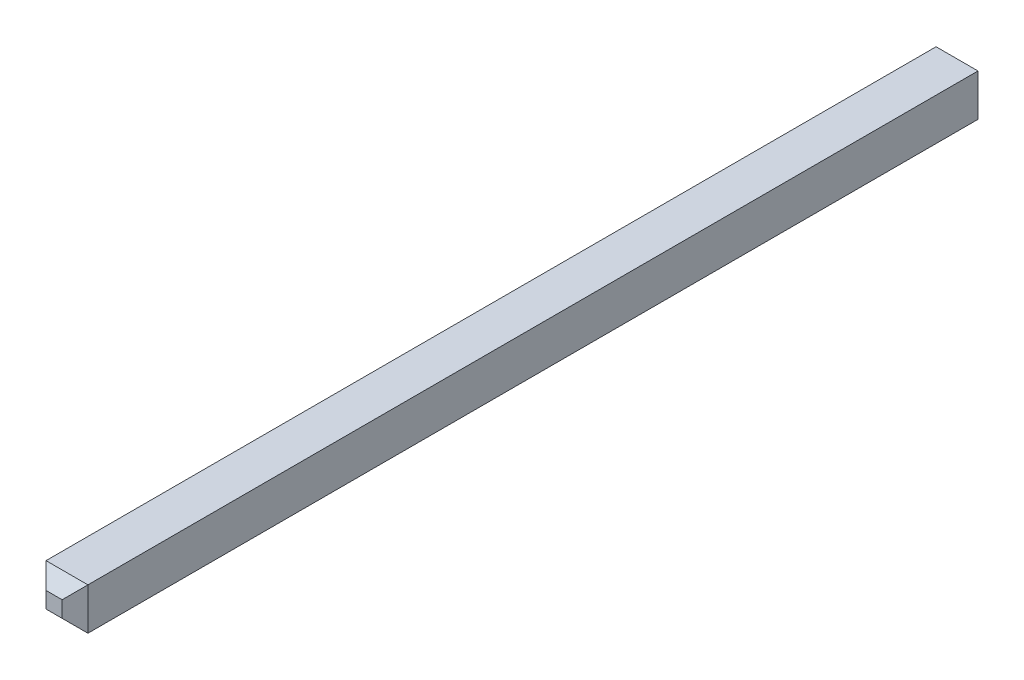
ISO-10303-21;
HEADER;
FILE_DESCRIPTION(('STEP AP214'),'2;1');
FILE_NAME('part.step','',(''),(''),'','','');
FILE_SCHEMA(('AUTOMOTIVE_DESIGN { 1 0 10303 214 1 1 1 1 }'));
ENDSEC;
DATA;
#1=APPLICATION_CONTEXT('core data for automotive mechanical design processes');
#2=APPLICATION_PROTOCOL_DEFINITION('international standard','automotive_design',2000,#1);
#3=PRODUCT_CONTEXT('',#1,'mechanical');
#4=PRODUCT('Part','Part','',(#3));
#5=PRODUCT_RELATED_PRODUCT_CATEGORY('part','',(#4));
#6=PRODUCT_DEFINITION_FORMATION('','',#4);
#7=PRODUCT_DEFINITION_CONTEXT('part definition',#1,'design');
#8=PRODUCT_DEFINITION('design','',#6,#7);
#9=PRODUCT_DEFINITION_SHAPE('','',#8);
#10=(LENGTH_UNIT() NAMED_UNIT(*) SI_UNIT(.MILLI.,.METRE.));
#11=(NAMED_UNIT(*) PLANE_ANGLE_UNIT() SI_UNIT($,.RADIAN.));
#12=(NAMED_UNIT(*) SI_UNIT($,.STERADIAN.) SOLID_ANGLE_UNIT());
#13=UNCERTAINTY_MEASURE_WITH_UNIT(LENGTH_MEASURE(1.E-05),#10,'distance_accuracy_value','');
#14=(GEOMETRIC_REPRESENTATION_CONTEXT(3) GLOBAL_UNCERTAINTY_ASSIGNED_CONTEXT((#13)) GLOBAL_UNIT_ASSIGNED_CONTEXT((#10,
#11,#12)) REPRESENTATION_CONTEXT('',''));
#15=CARTESIAN_POINT('',(0.,0.,0.));
#16=DIRECTION('',(0.,0.,1.));
#17=DIRECTION('',(1.,0.,0.));
#18=AXIS2_PLACEMENT_3D('',#15,#16,#17);
#19=CARTESIAN_POINT('',(-0.225,0.,-0.1));
#20=DIRECTION('',(-0.707106781186548,0.,0.707106781186548));
#21=DIRECTION('',(0.707106781186548,0.,0.707106781186548));
#22=AXIS2_PLACEMENT_3D('',#19,#20,#21);
#23=PLANE('',#22);
#24=DIRECTION('',(0.,1.,0.));
#25=VECTOR('',#24,1.);
#26=CARTESIAN_POINT('',(-0.325,0.325,-0.2));
#27=LINE('',#26,#25);
#28=CARTESIAN_POINT('',(-0.325,-0.325,-0.2));
#29=VERTEX_POINT('',#28);
#30=CARTESIAN_POINT('',(-0.325,0.325,-0.2));
#31=VERTEX_POINT('',#30);
#32=EDGE_CURVE('E114',#29,#31,#27,.T.);
#33=ORIENTED_EDGE('',*,*,#32,.F.);
#34=DIRECTION('',(-0.577350269189626,-0.577350269189626,-0.577350269189626));
#35=VECTOR('',#34,1.);
#36=CARTESIAN_POINT('',(-0.125,-0.125,0.));
#37=LINE('',#36,#35);
#38=CARTESIAN_POINT('',(-0.125,-0.125,0.));
#39=VERTEX_POINT('',#38);
#40=EDGE_CURVE('E112',#39,#29,#37,.T.);
#41=ORIENTED_EDGE('',*,*,#40,.F.);
#42=DIRECTION('',(0.,1.,0.));
#43=VECTOR('',#42,1.);
#44=CARTESIAN_POINT('',(-0.125,0.,0.));
#45=LINE('',#44,#43);
#46=CARTESIAN_POINT('',(-0.125,0.125,0.));
#47=VERTEX_POINT('',#46);
#48=EDGE_CURVE('E19',#47,#39,#45,.F.);
#49=ORIENTED_EDGE('',*,*,#48,.F.);
#50=DIRECTION('',(0.577350269189626,-0.577350269189626,0.577350269189626));
#51=VECTOR('',#50,1.);
#52=CARTESIAN_POINT('',(-0.325,0.325,-0.2));
#53=LINE('',#52,#51);
#54=EDGE_CURVE('E137',#31,#47,#53,.T.);
#55=ORIENTED_EDGE('',*,*,#54,.F.);
#56=EDGE_LOOP('',(#33,#41,#49,#55));
#57=FACE_BOUND('',#56,.T.);
#58=ADVANCED_FACE('F16',(#57),#23,.T.);
#59=CARTESIAN_POINT('',(-0.225,0.,-14.1));
#60=DIRECTION('',(-0.707106781186548,0.,-0.707106781186548));
#61=DIRECTION('',(-0.707106781186548,0.,0.707106781186548));
#62=AXIS2_PLACEMENT_3D('',#59,#60,#61);
#63=PLANE('',#62);
#64=DIRECTION('',(0.,1.,0.));
#65=VECTOR('',#64,1.);
#66=CARTESIAN_POINT('',(-0.125,0.,-14.2));
#67=LINE('',#66,#65);
#68=CARTESIAN_POINT('',(-0.125,0.125,-14.2));
#69=VERTEX_POINT('',#68);
#70=CARTESIAN_POINT('',(-0.125,-0.125,-14.2));
#71=VERTEX_POINT('',#70);
#72=EDGE_CURVE('E95',#69,#71,#67,.F.);
#73=ORIENTED_EDGE('',*,*,#72,.T.);
#74=DIRECTION('',(0.577350269189625,0.577350269189626,-0.577350269189626));
#75=VECTOR('',#74,1.);
#76=CARTESIAN_POINT('',(-0.325,-0.325000000000001,-14.));
#77=LINE('',#76,#75);
#78=CARTESIAN_POINT('',(-0.325,-0.325,-14.));
#79=VERTEX_POINT('',#78);
#80=EDGE_CURVE('E129',#79,#71,#77,.T.);
#81=ORIENTED_EDGE('',*,*,#80,.F.);
#82=DIRECTION('',(0.,1.,0.));
#83=VECTOR('',#82,1.);
#84=CARTESIAN_POINT('',(-0.325,0.325,-14.));
#85=LINE('',#84,#83);
#86=CARTESIAN_POINT('',(-0.325,0.325,-14.));
#87=VERTEX_POINT('',#86);
#88=EDGE_CURVE('E151',#87,#79,#85,.F.);
#89=ORIENTED_EDGE('',*,*,#88,.F.);
#90=DIRECTION('',(-0.577350269189625,0.577350269189626,0.577350269189626));
#91=VECTOR('',#90,1.);
#92=CARTESIAN_POINT('',(-0.125,0.125,-14.2));
#93=LINE('',#92,#91);
#94=EDGE_CURVE('E146',#69,#87,#93,.T.);
#95=ORIENTED_EDGE('',*,*,#94,.F.);
#96=EDGE_LOOP('',(#73,#81,#89,#95));
#97=FACE_BOUND('',#96,.T.);
#98=ADVANCED_FACE('F328',(#97),#63,.T.);
#99=CARTESIAN_POINT('',(0.,0.,0.));
#100=DIRECTION('',(0.,0.,1.));
#101=DIRECTION('',(1.,0.,0.));
#102=AXIS2_PLACEMENT_3D('',#99,#100,#101);
#103=PLANE('',#102);
#104=ORIENTED_EDGE('',*,*,#48,.T.);
#105=DIRECTION('',(1.,0.,0.));
#106=VECTOR('',#105,1.);
#107=CARTESIAN_POINT('',(0.,-0.125,0.));
#108=LINE('',#107,#106);
#109=CARTESIAN_POINT('',(0.125,-0.125,0.));
#110=VERTEX_POINT('',#109);
#111=EDGE_CURVE('E105',#110,#39,#108,.F.);
#112=ORIENTED_EDGE('',*,*,#111,.F.);
#113=DIRECTION('',(0.,1.,0.));
#114=VECTOR('',#113,1.);
#115=CARTESIAN_POINT('',(0.125,0.,0.));
#116=LINE('',#115,#114);
#117=CARTESIAN_POINT('',(0.125,0.125,0.));
#118=VERTEX_POINT('',#117);
#119=EDGE_CURVE('E159',#118,#110,#116,.F.);
#120=ORIENTED_EDGE('',*,*,#119,.F.);
#121=DIRECTION('',(1.,0.,0.));
#122=VECTOR('',#121,1.);
#123=CARTESIAN_POINT('',(0.,0.125,0.));
#124=LINE('',#123,#122);
#125=EDGE_CURVE('E107',#47,#118,#124,.T.);
#126=ORIENTED_EDGE('',*,*,#125,.F.);
#127=EDGE_LOOP('',(#104,#112,#120,#126));
#128=FACE_BOUND('',#127,.T.);
#129=ADVANCED_FACE('F102',(#128),#103,.T.);
#130=CARTESIAN_POINT('',(0.,-0.225,-0.1));
#131=DIRECTION('',(0.,-0.707106781186548,0.707106781186548));
#132=DIRECTION('',(0.,-0.707106781186548,-0.707106781186548));
#133=AXIS2_PLACEMENT_3D('',#130,#131,#132);
#134=PLANE('',#133);
#135=ORIENTED_EDGE('',*,*,#111,.T.);
#136=ORIENTED_EDGE('',*,*,#40,.T.);
#137=DIRECTION('',(1.,0.,0.));
#138=VECTOR('',#137,1.);
#139=CARTESIAN_POINT('',(-0.325,-0.325,-0.2));
#140=LINE('',#139,#138);
#141=CARTESIAN_POINT('',(0.325,-0.325,-0.2));
#142=VERTEX_POINT('',#141);
#143=EDGE_CURVE('E164',#142,#29,#140,.F.);
#144=ORIENTED_EDGE('',*,*,#143,.F.);
#145=DIRECTION('',(0.577350269189626,-0.577350269189626,-0.577350269189626));
#146=VECTOR('',#145,1.);
#147=CARTESIAN_POINT('',(0.125,-0.125,0.));
#148=LINE('',#147,#146);
#149=EDGE_CURVE('E121',#110,#142,#148,.T.);
#150=ORIENTED_EDGE('',*,*,#149,.F.);
#151=EDGE_LOOP('',(#135,#136,#144,#150));
#152=FACE_BOUND('',#151,.T.);
#153=ADVANCED_FACE('F119',(#152),#134,.T.);
#154=CARTESIAN_POINT('',(0.,0.,-14.2));
#155=DIRECTION('',(0.,0.,1.));
#156=DIRECTION('',(1.,0.,0.));
#157=AXIS2_PLACEMENT_3D('',#154,#155,#156);
#158=PLANE('',#157);
#159=DIRECTION('',(0.,1.,0.));
#160=VECTOR('',#159,1.);
#161=CARTESIAN_POINT('',(0.125,0.,-14.2));
#162=LINE('',#161,#160);
#163=CARTESIAN_POINT('',(0.125,-0.125,-14.2));
#164=VERTEX_POINT('',#163);
#165=CARTESIAN_POINT('',(0.125,0.125,-14.2));
#166=VERTEX_POINT('',#165);
#167=EDGE_CURVE('E175',#164,#166,#162,.T.);
#168=ORIENTED_EDGE('',*,*,#167,.F.);
#169=DIRECTION('',(1.,0.,0.));
#170=VECTOR('',#169,1.);
#171=CARTESIAN_POINT('',(0.,-0.125,-14.2));
#172=LINE('',#171,#170);
#173=EDGE_CURVE('E133',#71,#164,#172,.T.);
#174=ORIENTED_EDGE('',*,*,#173,.F.);
#175=ORIENTED_EDGE('',*,*,#72,.F.);
#176=DIRECTION('',(1.,0.,0.));
#177=VECTOR('',#176,1.);
#178=CARTESIAN_POINT('',(0.,0.125,-14.2));
#179=LINE('',#178,#177);
#180=EDGE_CURVE('E142',#166,#69,#179,.F.);
#181=ORIENTED_EDGE('',*,*,#180,.F.);
#182=EDGE_LOOP('',(#168,#174,#175,#181));
#183=FACE_BOUND('',#182,.T.);
#184=ADVANCED_FACE('F304',(#183),#158,.F.);
#185=CARTESIAN_POINT('',(0.,-0.225,-14.1));
#186=DIRECTION('',(0.,-0.707106781186548,-0.707106781186548));
#187=DIRECTION('',(0.,0.707106781186548,-0.707106781186548));
#188=AXIS2_PLACEMENT_3D('',#185,#186,#187);
#189=PLANE('',#188);
#190=ORIENTED_EDGE('',*,*,#173,.T.);
#191=DIRECTION('',(-0.577350269189626,0.577350269189625,-0.577350269189626));
#192=VECTOR('',#191,1.);
#193=CARTESIAN_POINT('',(0.325000000000001,-0.325,-14.));
#194=LINE('',#193,#192);
#195=CARTESIAN_POINT('',(0.325,-0.325,-14.));
#196=VERTEX_POINT('',#195);
#197=EDGE_CURVE('E182',#196,#164,#194,.T.);
#198=ORIENTED_EDGE('',*,*,#197,.F.);
#199=DIRECTION('',(1.,0.,0.));
#200=VECTOR('',#199,1.);
#201=CARTESIAN_POINT('',(-0.325,-0.325,-14.));
#202=LINE('',#201,#200);
#203=EDGE_CURVE('E171',#79,#196,#202,.T.);
#204=ORIENTED_EDGE('',*,*,#203,.F.);
#205=ORIENTED_EDGE('',*,*,#80,.T.);
#206=EDGE_LOOP('',(#190,#198,#204,#205));
#207=FACE_BOUND('',#206,.T.);
#208=ADVANCED_FACE('F296',(#207),#189,.T.);
#209=CARTESIAN_POINT('',(0.,0.225,-0.1));
#210=DIRECTION('',(0.,0.707106781186548,0.707106781186548));
#211=DIRECTION('',(0.,-0.707106781186548,0.707106781186548));
#212=AXIS2_PLACEMENT_3D('',#209,#210,#211);
#213=PLANE('',#212);
#214=ORIENTED_EDGE('',*,*,#125,.T.);
#215=DIRECTION('',(-0.577350269189626,-0.577350269189626,0.577350269189626));
#216=VECTOR('',#215,1.);
#217=CARTESIAN_POINT('',(0.325,0.325,-0.2));
#218=LINE('',#217,#216);
#219=CARTESIAN_POINT('',(0.325,0.325,-0.2));
#220=VERTEX_POINT('',#219);
#221=EDGE_CURVE('E155',#220,#118,#218,.T.);
#222=ORIENTED_EDGE('',*,*,#221,.F.);
#223=DIRECTION('',(1.,0.,0.));
#224=VECTOR('',#223,1.);
#225=CARTESIAN_POINT('',(0.325,0.325,-0.2));
#226=LINE('',#225,#224);
#227=EDGE_CURVE('E186',#31,#220,#226,.T.);
#228=ORIENTED_EDGE('',*,*,#227,.F.);
#229=ORIENTED_EDGE('',*,*,#54,.T.);
#230=EDGE_LOOP('',(#214,#222,#228,#229));
#231=FACE_BOUND('',#230,.T.);
#232=ADVANCED_FACE('F218',(#231),#213,.T.);
#233=CARTESIAN_POINT('',(0.,0.225,-14.1));
#234=DIRECTION('',(0.,0.707106781186548,-0.707106781186548));
#235=DIRECTION('',(0.,0.707106781186548,0.707106781186548));
#236=AXIS2_PLACEMENT_3D('',#233,#234,#235);
#237=PLANE('',#236);
#238=DIRECTION('',(1.,0.,0.));
#239=VECTOR('',#238,1.);
#240=CARTESIAN_POINT('',(0.325,0.325,-14.));
#241=LINE('',#240,#239);
#242=CARTESIAN_POINT('',(0.325,0.325,-14.));
#243=VERTEX_POINT('',#242);
#244=EDGE_CURVE('E39',#243,#87,#241,.F.);
#245=ORIENTED_EDGE('',*,*,#244,.F.);
#246=DIRECTION('',(0.577350269189626,0.577350269189625,0.577350269189626));
#247=VECTOR('',#246,1.);
#248=CARTESIAN_POINT('',(0.125,0.125,-14.2));
#249=LINE('',#248,#247);
#250=EDGE_CURVE('E179',#166,#243,#249,.T.);
#251=ORIENTED_EDGE('',*,*,#250,.F.);
#252=ORIENTED_EDGE('',*,*,#180,.T.);
#253=ORIENTED_EDGE('',*,*,#94,.T.);
#254=EDGE_LOOP('',(#245,#251,#252,#253));
#255=FACE_BOUND('',#254,.T.);
#256=ADVANCED_FACE('F235',(#255),#237,.T.);
#257=CARTESIAN_POINT('',(-0.325,0.325,0.));
#258=DIRECTION('',(-1.,0.,0.));
#259=DIRECTION('',(0.,0.,1.));
#260=AXIS2_PLACEMENT_3D('',#257,#258,#259);
#261=PLANE('',#260);
#262=ORIENTED_EDGE('',*,*,#88,.T.);
#263=DIRECTION('',(0.,0.,-1.));
#264=VECTOR('',#263,1.);
#265=CARTESIAN_POINT('',(-0.325,-0.325,0.));
#266=LINE('',#265,#264);
#267=EDGE_CURVE('E167',#29,#79,#266,.T.);
#268=ORIENTED_EDGE('',*,*,#267,.F.);
#269=ORIENTED_EDGE('',*,*,#32,.T.);
#270=DIRECTION('',(0.,0.,1.));
#271=VECTOR('',#270,1.);
#272=CARTESIAN_POINT('',(-0.325,0.325,0.));
#273=LINE('',#272,#271);
#274=EDGE_CURVE('E192',#87,#31,#273,.T.);
#275=ORIENTED_EDGE('',*,*,#274,.F.);
#276=EDGE_LOOP('',(#262,#268,#269,#275));
#277=FACE_BOUND('',#276,.T.);
#278=ADVANCED_FACE('F221',(#277),#261,.T.);
#279=CARTESIAN_POINT('',(0.225,0.,-0.1));
#280=DIRECTION('',(0.707106781186548,0.,0.707106781186548));
#281=DIRECTION('',(0.707106781186548,0.,-0.707106781186548));
#282=AXIS2_PLACEMENT_3D('',#279,#280,#281);
#283=PLANE('',#282);
#284=ORIENTED_EDGE('',*,*,#119,.T.);
#285=ORIENTED_EDGE('',*,*,#149,.T.);
#286=DIRECTION('',(0.,1.,0.));
#287=VECTOR('',#286,1.);
#288=CARTESIAN_POINT('',(0.325,-0.325,-0.2));
#289=LINE('',#288,#287);
#290=EDGE_CURVE('E196',#220,#142,#289,.F.);
#291=ORIENTED_EDGE('',*,*,#290,.F.);
#292=ORIENTED_EDGE('',*,*,#221,.T.);
#293=EDGE_LOOP('',(#284,#285,#291,#292));
#294=FACE_BOUND('',#293,.T.);
#295=ADVANCED_FACE('F226',(#294),#283,.T.);
#296=CARTESIAN_POINT('',(-0.325,-0.325,0.));
#297=DIRECTION('',(0.,-1.,0.));
#298=DIRECTION('',(0.,0.,-1.));
#299=AXIS2_PLACEMENT_3D('',#296,#297,#298);
#300=PLANE('',#299);
#301=ORIENTED_EDGE('',*,*,#203,.T.);
#302=DIRECTION('',(0.,0.,-1.));
#303=VECTOR('',#302,1.);
#304=CARTESIAN_POINT('',(0.325,-0.325,0.));
#305=LINE('',#304,#303);
#306=EDGE_CURVE('E200',#142,#196,#305,.T.);
#307=ORIENTED_EDGE('',*,*,#306,.F.);
#308=ORIENTED_EDGE('',*,*,#143,.T.);
#309=ORIENTED_EDGE('',*,*,#267,.T.);
#310=EDGE_LOOP('',(#301,#307,#308,#309));
#311=FACE_BOUND('',#310,.T.);
#312=ADVANCED_FACE('F224',(#311),#300,.T.);
#313=CARTESIAN_POINT('',(0.225,0.,-14.1));
#314=DIRECTION('',(0.707106781186548,0.,-0.707106781186548));
#315=DIRECTION('',(-0.707106781186548,0.,-0.707106781186548));
#316=AXIS2_PLACEMENT_3D('',#313,#314,#315);
#317=PLANE('',#316);
#318=DIRECTION('',(0.,1.,0.));
#319=VECTOR('',#318,1.);
#320=CARTESIAN_POINT('',(0.325,-0.325,-14.));
#321=LINE('',#320,#319);
#322=EDGE_CURVE('E26',#196,#243,#321,.T.);
#323=ORIENTED_EDGE('',*,*,#322,.F.);
#324=ORIENTED_EDGE('',*,*,#197,.T.);
#325=ORIENTED_EDGE('',*,*,#167,.T.);
#326=ORIENTED_EDGE('',*,*,#250,.T.);
#327=EDGE_LOOP('',(#323,#324,#325,#326));
#328=FACE_BOUND('',#327,.T.);
#329=ADVANCED_FACE('F212',(#328),#317,.T.);
#330=CARTESIAN_POINT('',(0.325,0.325,0.));
#331=DIRECTION('',(0.,1.,0.));
#332=DIRECTION('',(0.,0.,1.));
#333=AXIS2_PLACEMENT_3D('',#330,#331,#332);
#334=PLANE('',#333);
#335=ORIENTED_EDGE('',*,*,#244,.T.);
#336=ORIENTED_EDGE('',*,*,#274,.T.);
#337=ORIENTED_EDGE('',*,*,#227,.T.);
#338=DIRECTION('',(0.,0.,-1.));
#339=VECTOR('',#338,1.);
#340=CARTESIAN_POINT('',(0.325,0.325,0.));
#341=LINE('',#340,#339);
#342=EDGE_CURVE('E11',#243,#220,#341,.F.);
#343=ORIENTED_EDGE('',*,*,#342,.F.);
#344=EDGE_LOOP('',(#335,#336,#337,#343));
#345=FACE_BOUND('',#344,.T.);
#346=ADVANCED_FACE('F214',(#345),#334,.T.);
#347=CARTESIAN_POINT('',(0.325,-0.325,0.));
#348=DIRECTION('',(1.,0.,0.));
#349=DIRECTION('',(0.,0.,-1.));
#350=AXIS2_PLACEMENT_3D('',#347,#348,#349);
#351=PLANE('',#350);
#352=ORIENTED_EDGE('',*,*,#322,.T.);
#353=ORIENTED_EDGE('',*,*,#342,.T.);
#354=ORIENTED_EDGE('',*,*,#290,.T.);
#355=ORIENTED_EDGE('',*,*,#306,.T.);
#356=EDGE_LOOP('',(#352,#353,#354,#355));
#357=FACE_BOUND('',#356,.T.);
#358=ADVANCED_FACE('F208',(#357),#351,.T.);
#359=CLOSED_SHELL('',(#58,#98,#129,#153,#184,#208,#232,#256,#278,#295,#312,#329,#346,#358));
#360=MANIFOLD_SOLID_BREP('B1',#359);
#361=ADVANCED_BREP_SHAPE_REPRESENTATION('',(#18,#360),#14);
#362=SHAPE_DEFINITION_REPRESENTATION(#9,#361);
ENDSEC;
END-ISO-10303-21;
